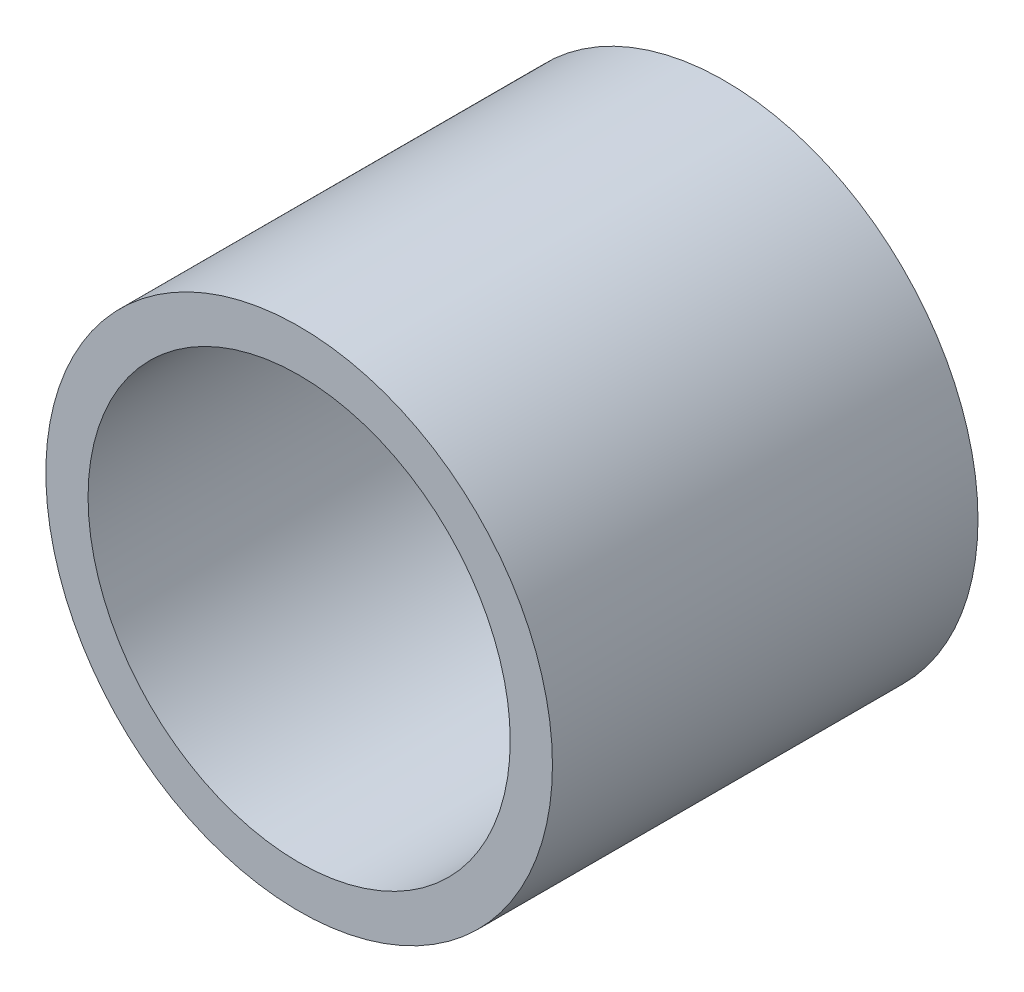
ISO-10303-21;
HEADER;
FILE_DESCRIPTION(('STEP AP214'),'2;1');
FILE_NAME('part.step','',(''),(''),'','','');
FILE_SCHEMA(('AUTOMOTIVE_DESIGN { 1 0 10303 214 1 1 1 1 }'));
ENDSEC;
DATA;
#1=APPLICATION_CONTEXT('core data for automotive mechanical design processes');
#2=APPLICATION_PROTOCOL_DEFINITION('international standard','automotive_design',2000,#1);
#3=PRODUCT_CONTEXT('',#1,'mechanical');
#4=PRODUCT('Part','Part','',(#3));
#5=PRODUCT_RELATED_PRODUCT_CATEGORY('part','',(#4));
#6=PRODUCT_DEFINITION_FORMATION('','',#4);
#7=PRODUCT_DEFINITION_CONTEXT('part definition',#1,'design');
#8=PRODUCT_DEFINITION('design','',#6,#7);
#9=PRODUCT_DEFINITION_SHAPE('','',#8);
#10=(LENGTH_UNIT() NAMED_UNIT(*) SI_UNIT(.MILLI.,.METRE.));
#11=(NAMED_UNIT(*) PLANE_ANGLE_UNIT() SI_UNIT($,.RADIAN.));
#12=(NAMED_UNIT(*) SI_UNIT($,.STERADIAN.) SOLID_ANGLE_UNIT());
#13=UNCERTAINTY_MEASURE_WITH_UNIT(LENGTH_MEASURE(1.E-05),#10,'distance_accuracy_value','');
#14=(GEOMETRIC_REPRESENTATION_CONTEXT(3) GLOBAL_UNCERTAINTY_ASSIGNED_CONTEXT((#13)) GLOBAL_UNIT_ASSIGNED_CONTEXT((#10,
#11,#12)) REPRESENTATION_CONTEXT('',''));
#15=CARTESIAN_POINT('',(0.,0.,0.));
#16=DIRECTION('',(0.,0.,1.));
#17=DIRECTION('',(1.,0.,0.));
#18=AXIS2_PLACEMENT_3D('',#15,#16,#17);
#19=CARTESIAN_POINT('',(0.,0.,8.001));
#20=DIRECTION('',(0.,0.,1.));
#21=DIRECTION('',(1.,0.,0.));
#22=AXIS2_PLACEMENT_3D('',#19,#20,#21);
#23=PLANE('',#22);
#24=CARTESIAN_POINT('',(0.,0.,8.001));
#25=DIRECTION('',(0.,0.,1.));
#26=DIRECTION('',(1.,0.,0.));
#27=AXIS2_PLACEMENT_3D('',#24,#25,#26);
#28=CIRCLE('',#27,9.525);
#29=CARTESIAN_POINT('',(9.525,0.,8.001));
#30=VERTEX_POINT('',#29);
#31=EDGE_CURVE('E10',#30,#30,#28,.T.);
#32=ORIENTED_EDGE('',*,*,#31,.T.);
#33=EDGE_LOOP('',(#32));
#34=FACE_BOUND('',#33,.T.);
#35=CARTESIAN_POINT('',(0.,0.,8.001));
#36=DIRECTION('',(0.,0.,1.));
#37=DIRECTION('',(1.,0.,0.));
#38=AXIS2_PLACEMENT_3D('',#35,#36,#37);
#39=CIRCLE('',#38,7.9375);
#40=CARTESIAN_POINT('',(7.9375,0.,8.001));
#41=VERTEX_POINT('',#40);
#42=EDGE_CURVE('E43',#41,#41,#39,.T.);
#43=ORIENTED_EDGE('',*,*,#42,.F.);
#44=EDGE_LOOP('',(#43));
#45=FACE_BOUND('',#44,.T.);
#46=ADVANCED_FACE('F32',(#34,#45),#23,.T.);
#47=CARTESIAN_POINT('',(0.,0.,-8.001));
#48=DIRECTION('',(0.,0.,1.));
#49=DIRECTION('',(1.,0.,0.));
#50=AXIS2_PLACEMENT_3D('',#47,#48,#49);
#51=PLANE('',#50);
#52=CARTESIAN_POINT('',(0.,0.,-8.001));
#53=DIRECTION('',(0.,0.,1.));
#54=DIRECTION('',(1.,0.,0.));
#55=AXIS2_PLACEMENT_3D('',#52,#53,#54);
#56=CIRCLE('',#55,9.525);
#57=CARTESIAN_POINT('',(9.525,0.,-8.001));
#58=VERTEX_POINT('',#57);
#59=EDGE_CURVE('E36',#58,#58,#56,.T.);
#60=ORIENTED_EDGE('',*,*,#59,.F.);
#61=EDGE_LOOP('',(#60));
#62=FACE_BOUND('',#61,.T.);
#63=CARTESIAN_POINT('',(0.,0.,-8.001));
#64=DIRECTION('',(0.,0.,1.));
#65=DIRECTION('',(1.,0.,0.));
#66=AXIS2_PLACEMENT_3D('',#63,#64,#65);
#67=CIRCLE('',#66,7.9375);
#68=CARTESIAN_POINT('',(7.9375,0.,-8.001));
#69=VERTEX_POINT('',#68);
#70=EDGE_CURVE('E45',#69,#69,#67,.T.);
#71=ORIENTED_EDGE('',*,*,#70,.T.);
#72=EDGE_LOOP('',(#71));
#73=FACE_BOUND('',#72,.T.);
#74=ADVANCED_FACE('F55',(#62,#73),#51,.F.);
#75=CARTESIAN_POINT('',(0.,0.,8.001));
#76=DIRECTION('',(0.,0.,-1.));
#77=DIRECTION('',(-1.,0.,0.));
#78=AXIS2_PLACEMENT_3D('',#75,#76,#77);
#79=CYLINDRICAL_SURFACE('',#78,9.525);
#80=ORIENTED_EDGE('',*,*,#31,.F.);
#81=EDGE_LOOP('',(#80));
#82=FACE_BOUND('',#81,.T.);
#83=ORIENTED_EDGE('',*,*,#59,.T.);
#84=EDGE_LOOP('',(#83));
#85=FACE_BOUND('',#84,.T.);
#86=ADVANCED_FACE('F34',(#82,#85),#79,.T.);
#87=CARTESIAN_POINT('',(0.,0.,8.001));
#88=DIRECTION('',(0.,0.,-1.));
#89=DIRECTION('',(-1.,0.,0.));
#90=AXIS2_PLACEMENT_3D('',#87,#88,#89);
#91=CYLINDRICAL_SURFACE('',#90,7.9375);
#92=ORIENTED_EDGE('',*,*,#42,.T.);
#93=EDGE_LOOP('',(#92));
#94=FACE_BOUND('',#93,.T.);
#95=ORIENTED_EDGE('',*,*,#70,.F.);
#96=EDGE_LOOP('',(#95));
#97=FACE_BOUND('',#96,.T.);
#98=ADVANCED_FACE('F51',(#94,#97),#91,.F.);
#99=CLOSED_SHELL('',(#46,#74,#86,#98));
#100=MANIFOLD_SOLID_BREP('B2',#99);
#101=ADVANCED_BREP_SHAPE_REPRESENTATION('',(#18,#100),#14);
#102=SHAPE_DEFINITION_REPRESENTATION(#9,#101);
ENDSEC;
END-ISO-10303-21;
